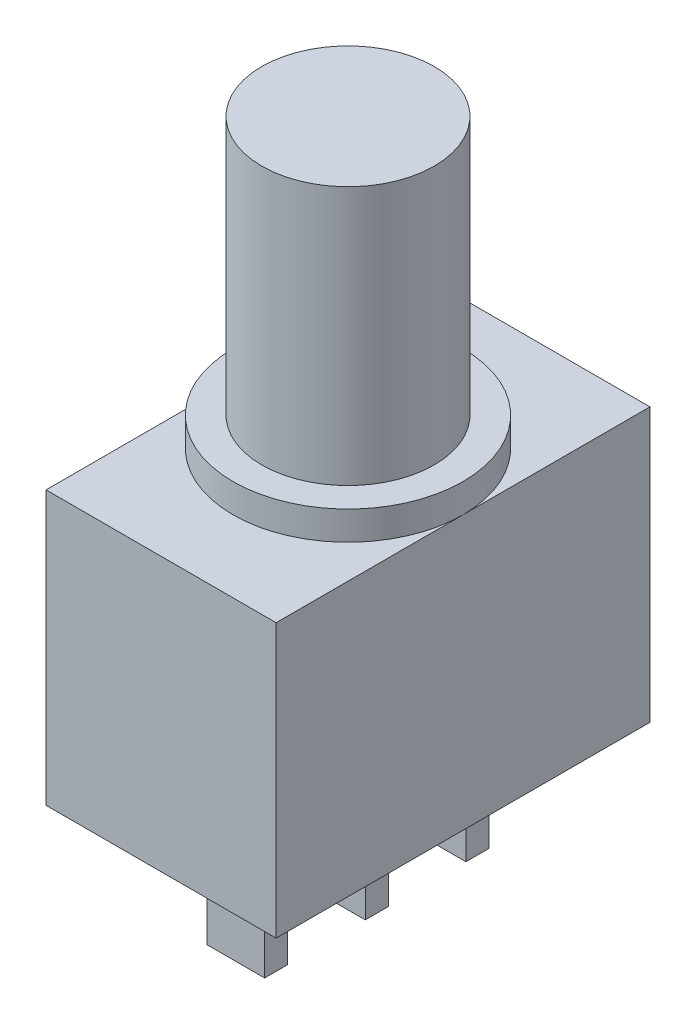
ISO-10303-21;
HEADER;
FILE_DESCRIPTION(('STEP AP214'),'2;1');
FILE_NAME('part.step','',(''),(''),'','','');
FILE_SCHEMA(('AUTOMOTIVE_DESIGN { 1 0 10303 214 1 1 1 1 }'));
ENDSEC;
DATA;
#1=APPLICATION_CONTEXT('core data for automotive mechanical design processes');
#2=APPLICATION_PROTOCOL_DEFINITION('international standard','automotive_design',2000,#1);
#3=PRODUCT_CONTEXT('',#1,'mechanical');
#4=PRODUCT('Part','Part','',(#3));
#5=PRODUCT_RELATED_PRODUCT_CATEGORY('part','',(#4));
#6=PRODUCT_DEFINITION_FORMATION('','',#4);
#7=PRODUCT_DEFINITION_CONTEXT('part definition',#1,'design');
#8=PRODUCT_DEFINITION('design','',#6,#7);
#9=PRODUCT_DEFINITION_SHAPE('','',#8);
#10=(LENGTH_UNIT() NAMED_UNIT(*) SI_UNIT(.MILLI.,.METRE.));
#11=(NAMED_UNIT(*) PLANE_ANGLE_UNIT() SI_UNIT($,.RADIAN.));
#12=(NAMED_UNIT(*) SI_UNIT($,.STERADIAN.) SOLID_ANGLE_UNIT());
#13=UNCERTAINTY_MEASURE_WITH_UNIT(LENGTH_MEASURE(1.E-05),#10,'distance_accuracy_value','');
#14=(GEOMETRIC_REPRESENTATION_CONTEXT(3) GLOBAL_UNCERTAINTY_ASSIGNED_CONTEXT((#13)) GLOBAL_UNIT_ASSIGNED_CONTEXT((#10,
#11,#12)) REPRESENTATION_CONTEXT('',''));
#15=CARTESIAN_POINT('',(0.,0.,0.));
#16=DIRECTION('',(0.,0.,1.));
#17=DIRECTION('',(1.,0.,0.));
#18=AXIS2_PLACEMENT_3D('',#15,#16,#17);
#19=CARTESIAN_POINT('',(8.,0.,0.));
#20=DIRECTION('',(0.,1.,0.));
#21=DIRECTION('',(0.,0.,1.));
#22=AXIS2_PLACEMENT_3D('',#19,#20,#21);
#23=PLANE('',#22);
#24=DIRECTION('',(0.,0.,1.));
#25=VECTOR('',#24,1.);
#26=CARTESIAN_POINT('',(5.,0.,-6.1));
#27=LINE('',#26,#25);
#28=CARTESIAN_POINT('',(5.,0.,-6.9));
#29=VERTEX_POINT('',#28);
#30=CARTESIAN_POINT('',(5.,0.,-6.1));
#31=VERTEX_POINT('',#30);
#32=EDGE_CURVE('E174',#29,#31,#27,.T.);
#33=ORIENTED_EDGE('',*,*,#32,.F.);
#34=DIRECTION('',(1.,0.,0.));
#35=VECTOR('',#34,1.);
#36=CARTESIAN_POINT('',(5.,0.,-6.9));
#37=LINE('',#36,#35);
#38=CARTESIAN_POINT('',(3.,0.,-6.9));
#39=VERTEX_POINT('',#38);
#40=EDGE_CURVE('E187',#39,#29,#37,.T.);
#41=ORIENTED_EDGE('',*,*,#40,.F.);
#42=DIRECTION('',(0.,0.,-1.));
#43=VECTOR('',#42,1.);
#44=CARTESIAN_POINT('',(3.,0.,-6.1));
#45=LINE('',#44,#43);
#46=CARTESIAN_POINT('',(3.,0.,-6.1));
#47=VERTEX_POINT('',#46);
#48=EDGE_CURVE('E196',#47,#39,#45,.T.);
#49=ORIENTED_EDGE('',*,*,#48,.F.);
#50=DIRECTION('',(-1.,0.,0.));
#51=VECTOR('',#50,1.);
#52=CARTESIAN_POINT('',(5.,0.,-6.1));
#53=LINE('',#52,#51);
#54=EDGE_CURVE('E177',#31,#47,#53,.T.);
#55=ORIENTED_EDGE('',*,*,#54,.F.);
#56=EDGE_LOOP('',(#33,#41,#49,#55));
#57=FACE_BOUND('',#56,.T.);
#58=DIRECTION('',(0.,0.,-1.));
#59=VECTOR('',#58,1.);
#60=CARTESIAN_POINT('',(0.,0.,0.));
#61=LINE('',#60,#59);
#62=CARTESIAN_POINT('',(0.,0.,0.));
#63=VERTEX_POINT('',#62);
#64=CARTESIAN_POINT('',(0.,0.,-13.));
#65=VERTEX_POINT('',#64);
#66=EDGE_CURVE('E270',#63,#65,#61,.T.);
#67=ORIENTED_EDGE('',*,*,#66,.T.);
#68=DIRECTION('',(-1.,0.,0.));
#69=VECTOR('',#68,1.);
#70=CARTESIAN_POINT('',(8.,0.,-13.));
#71=LINE('',#70,#69);
#72=CARTESIAN_POINT('',(8.,0.,-13.));
#73=VERTEX_POINT('',#72);
#74=EDGE_CURVE('E281',#73,#65,#71,.T.);
#75=ORIENTED_EDGE('',*,*,#74,.F.);
#76=DIRECTION('',(0.,0.,-1.));
#77=VECTOR('',#76,1.);
#78=CARTESIAN_POINT('',(8.,0.,0.));
#79=LINE('',#78,#77);
#80=CARTESIAN_POINT('',(8.,0.,0.));
#81=VERTEX_POINT('',#80);
#82=EDGE_CURVE('E259',#81,#73,#79,.T.);
#83=ORIENTED_EDGE('',*,*,#82,.F.);
#84=DIRECTION('',(-1.,0.,0.));
#85=VECTOR('',#84,1.);
#86=CARTESIAN_POINT('',(8.,0.,0.));
#87=LINE('',#86,#85);
#88=EDGE_CURVE('E36',#81,#63,#87,.T.);
#89=ORIENTED_EDGE('',*,*,#88,.T.);
#90=EDGE_LOOP('',(#67,#75,#83,#89));
#91=FACE_BOUND('',#90,.T.);
#92=DIRECTION('',(0.,0.,1.));
#93=VECTOR('',#92,1.);
#94=CARTESIAN_POINT('',(5.,0.,-2.6));
#95=LINE('',#94,#93);
#96=CARTESIAN_POINT('',(5.,0.,-3.4));
#97=VERTEX_POINT('',#96);
#98=CARTESIAN_POINT('',(5.,0.,-2.6));
#99=VERTEX_POINT('',#98);
#100=EDGE_CURVE('E212',#97,#99,#95,.T.);
#101=ORIENTED_EDGE('',*,*,#100,.F.);
#102=DIRECTION('',(1.,0.,0.));
#103=VECTOR('',#102,1.);
#104=CARTESIAN_POINT('',(5.,0.,-3.4));
#105=LINE('',#104,#103);
#106=CARTESIAN_POINT('',(3.,0.,-3.4));
#107=VERTEX_POINT('',#106);
#108=EDGE_CURVE('E217',#107,#97,#105,.T.);
#109=ORIENTED_EDGE('',*,*,#108,.F.);
#110=DIRECTION('',(0.,0.,-1.));
#111=VECTOR('',#110,1.);
#112=CARTESIAN_POINT('',(3.,0.,-2.6));
#113=LINE('',#112,#111);
#114=CARTESIAN_POINT('',(3.,0.,-2.6));
#115=VERTEX_POINT('',#114);
#116=EDGE_CURVE('E229',#115,#107,#113,.T.);
#117=ORIENTED_EDGE('',*,*,#116,.F.);
#118=DIRECTION('',(-1.,0.,0.));
#119=VECTOR('',#118,1.);
#120=CARTESIAN_POINT('',(5.,0.,-2.6));
#121=LINE('',#120,#119);
#122=EDGE_CURVE('E226',#99,#115,#121,.T.);
#123=ORIENTED_EDGE('',*,*,#122,.F.);
#124=EDGE_LOOP('',(#101,#109,#117,#123));
#125=FACE_BOUND('',#124,.T.);
#126=DIRECTION('',(0.,0.,1.));
#127=VECTOR('',#126,1.);
#128=CARTESIAN_POINT('',(5.,0.,-9.6));
#129=LINE('',#128,#127);
#130=CARTESIAN_POINT('',(5.,0.,-10.4));
#131=VERTEX_POINT('',#130);
#132=CARTESIAN_POINT('',(5.,0.,-9.6));
#133=VERTEX_POINT('',#132);
#134=EDGE_CURVE('E173',#131,#133,#129,.T.);
#135=ORIENTED_EDGE('',*,*,#134,.F.);
#136=DIRECTION('',(1.,0.,0.));
#137=VECTOR('',#136,1.);
#138=CARTESIAN_POINT('',(5.,0.,-10.4));
#139=LINE('',#138,#137);
#140=CARTESIAN_POINT('',(3.,0.,-10.4));
#141=VERTEX_POINT('',#140);
#142=EDGE_CURVE('E170',#141,#131,#139,.T.);
#143=ORIENTED_EDGE('',*,*,#142,.F.);
#144=DIRECTION('',(0.,0.,-1.));
#145=VECTOR('',#144,1.);
#146=CARTESIAN_POINT('',(3.,0.,-9.6));
#147=LINE('',#146,#145);
#148=CARTESIAN_POINT('',(3.,0.,-9.6));
#149=VERTEX_POINT('',#148);
#150=EDGE_CURVE('E54',#149,#141,#147,.T.);
#151=ORIENTED_EDGE('',*,*,#150,.F.);
#152=DIRECTION('',(-1.,0.,0.));
#153=VECTOR('',#152,1.);
#154=CARTESIAN_POINT('',(5.,0.,-9.6));
#155=LINE('',#154,#153);
#156=EDGE_CURVE('E49',#133,#149,#155,.T.);
#157=ORIENTED_EDGE('',*,*,#156,.F.);
#158=EDGE_LOOP('',(#135,#143,#151,#157));
#159=FACE_BOUND('',#158,.T.);
#160=ADVANCED_FACE('F32',(#57,#91,#125,#159),#23,.F.);
#161=CARTESIAN_POINT('',(4.,10.5,-6.5));
#162=DIRECTION('',(0.,1.,0.));
#163=DIRECTION('',(0.,0.,1.));
#164=AXIS2_PLACEMENT_3D('',#161,#162,#163);
#165=PLANE('',#164);
#166=CARTESIAN_POINT('',(4.,10.5,-6.5));
#167=DIRECTION('',(0.,1.,0.));
#168=DIRECTION('',(0.,0.,1.));
#169=AXIS2_PLACEMENT_3D('',#166,#167,#168);
#170=CIRCLE('',#169,4.);
#171=CARTESIAN_POINT('',(4.,10.5,-2.5));
#172=VERTEX_POINT('',#171);
#173=EDGE_CURVE('E251',#172,#172,#170,.T.);
#174=ORIENTED_EDGE('',*,*,#173,.T.);
#175=EDGE_LOOP('',(#174));
#176=FACE_BOUND('',#175,.T.);
#177=CARTESIAN_POINT('',(4.,10.5,-6.5));
#178=DIRECTION('',(0.,1.,0.));
#179=DIRECTION('',(0.,0.,1.));
#180=AXIS2_PLACEMENT_3D('',#177,#178,#179);
#181=CIRCLE('',#180,3.);
#182=CARTESIAN_POINT('',(4.,10.5,-3.5));
#183=VERTEX_POINT('',#182);
#184=EDGE_CURVE('E245',#183,#183,#181,.T.);
#185=ORIENTED_EDGE('',*,*,#184,.F.);
#186=EDGE_LOOP('',(#185));
#187=FACE_BOUND('',#186,.T.);
#188=ADVANCED_FACE('F328',(#176,#187),#165,.T.);
#189=CARTESIAN_POINT('',(8.,9.5,0.));
#190=DIRECTION('',(0.,-1.,0.));
#191=DIRECTION('',(0.,0.,-1.));
#192=AXIS2_PLACEMENT_3D('',#189,#190,#191);
#193=PLANE('',#192);
#194=CARTESIAN_POINT('',(4.,9.5,-6.5));
#195=DIRECTION('',(0.,1.,0.));
#196=DIRECTION('',(0.,0.,1.));
#197=AXIS2_PLACEMENT_3D('',#194,#195,#196);
#198=CIRCLE('',#197,4.);
#199=CARTESIAN_POINT('',(8.,9.5,-6.5));
#200=VERTEX_POINT('',#199);
#201=CARTESIAN_POINT('',(0.,9.5,-6.5));
#202=VERTEX_POINT('',#201);
#203=EDGE_CURVE('E42',#200,#202,#198,.T.);
#204=ORIENTED_EDGE('',*,*,#203,.F.);
#205=DIRECTION('',(0.,0.,1.));
#206=VECTOR('',#205,1.);
#207=CARTESIAN_POINT('',(8.,9.5,0.));
#208=LINE('',#207,#206);
#209=CARTESIAN_POINT('',(8.,9.5,-13.));
#210=VERTEX_POINT('',#209);
#211=EDGE_CURVE('E265',#210,#200,#208,.T.);
#212=ORIENTED_EDGE('',*,*,#211,.F.);
#213=DIRECTION('',(-1.,0.,0.));
#214=VECTOR('',#213,1.);
#215=CARTESIAN_POINT('',(8.,9.5,-13.));
#216=LINE('',#215,#214);
#217=CARTESIAN_POINT('',(0.,9.5,-13.));
#218=VERTEX_POINT('',#217);
#219=EDGE_CURVE('E279',#210,#218,#216,.T.);
#220=ORIENTED_EDGE('',*,*,#219,.T.);
#221=DIRECTION('',(0.,0.,1.));
#222=VECTOR('',#221,1.);
#223=CARTESIAN_POINT('',(0.,9.5,0.));
#224=LINE('',#223,#222);
#225=EDGE_CURVE('E260',#218,#202,#224,.T.);
#226=ORIENTED_EDGE('',*,*,#225,.T.);
#227=EDGE_LOOP('',(#204,#212,#220,#226));
#228=FACE_BOUND('',#227,.T.);
#229=ADVANCED_FACE('F304',(#228),#193,.F.);
#230=EDGE_CURVE('E11',#202,#200,#198,.T.);
#231=ORIENTED_EDGE('',*,*,#230,.F.);
#232=CARTESIAN_POINT('',(0.,9.5,0.));
#233=VERTEX_POINT('',#232);
#234=EDGE_CURVE('E274',#202,#233,#224,.T.);
#235=ORIENTED_EDGE('',*,*,#234,.T.);
#236=DIRECTION('',(-1.,0.,0.));
#237=VECTOR('',#236,1.);
#238=CARTESIAN_POINT('',(8.,9.5,0.));
#239=LINE('',#238,#237);
#240=CARTESIAN_POINT('',(8.,9.5,0.));
#241=VERTEX_POINT('',#240);
#242=EDGE_CURVE('E267',#241,#233,#239,.T.);
#243=ORIENTED_EDGE('',*,*,#242,.F.);
#244=EDGE_CURVE('E264',#200,#241,#208,.T.);
#245=ORIENTED_EDGE('',*,*,#244,.F.);
#246=EDGE_LOOP('',(#231,#235,#243,#245));
#247=FACE_BOUND('',#246,.T.);
#248=ADVANCED_FACE('F309',(#247),#193,.F.);
#249=CARTESIAN_POINT('',(8.,0.,0.));
#250=DIRECTION('',(0.,0.,-1.));
#251=DIRECTION('',(-1.,0.,0.));
#252=AXIS2_PLACEMENT_3D('',#249,#250,#251);
#253=PLANE('',#252);
#254=DIRECTION('',(0.,-1.,0.));
#255=VECTOR('',#254,1.);
#256=CARTESIAN_POINT('',(0.,0.,0.));
#257=LINE('',#256,#255);
#258=EDGE_CURVE('E253',#233,#63,#257,.T.);
#259=ORIENTED_EDGE('',*,*,#258,.T.);
#260=ORIENTED_EDGE('',*,*,#88,.F.);
#261=DIRECTION('',(0.,-1.,0.));
#262=VECTOR('',#261,1.);
#263=CARTESIAN_POINT('',(8.,0.,0.));
#264=LINE('',#263,#262);
#265=EDGE_CURVE('E256',#241,#81,#264,.T.);
#266=ORIENTED_EDGE('',*,*,#265,.F.);
#267=ORIENTED_EDGE('',*,*,#242,.T.);
#268=EDGE_LOOP('',(#259,#260,#266,#267));
#269=FACE_BOUND('',#268,.T.);
#270=ADVANCED_FACE('F34',(#269),#253,.F.);
#271=CARTESIAN_POINT('',(8.,0.,-13.));
#272=DIRECTION('',(0.,0.,1.));
#273=DIRECTION('',(1.,0.,0.));
#274=AXIS2_PLACEMENT_3D('',#271,#272,#273);
#275=PLANE('',#274);
#276=DIRECTION('',(0.,1.,0.));
#277=VECTOR('',#276,1.);
#278=CARTESIAN_POINT('',(0.,0.,-13.));
#279=LINE('',#278,#277);
#280=EDGE_CURVE('E272',#65,#218,#279,.T.);
#281=ORIENTED_EDGE('',*,*,#280,.T.);
#282=ORIENTED_EDGE('',*,*,#219,.F.);
#283=DIRECTION('',(0.,1.,0.));
#284=VECTOR('',#283,1.);
#285=CARTESIAN_POINT('',(8.,0.,-13.));
#286=LINE('',#285,#284);
#287=EDGE_CURVE('E262',#73,#210,#286,.T.);
#288=ORIENTED_EDGE('',*,*,#287,.F.);
#289=ORIENTED_EDGE('',*,*,#74,.T.);
#290=EDGE_LOOP('',(#281,#282,#288,#289));
#291=FACE_BOUND('',#290,.T.);
#292=ADVANCED_FACE('F300',(#291),#275,.F.);
#293=CARTESIAN_POINT('',(8.,0.,0.));
#294=DIRECTION('',(-1.,0.,0.));
#295=DIRECTION('',(0.,0.,1.));
#296=AXIS2_PLACEMENT_3D('',#293,#294,#295);
#297=PLANE('',#296);
#298=ORIENTED_EDGE('',*,*,#265,.T.);
#299=ORIENTED_EDGE('',*,*,#82,.T.);
#300=ORIENTED_EDGE('',*,*,#287,.T.);
#301=ORIENTED_EDGE('',*,*,#211,.T.);
#302=ORIENTED_EDGE('',*,*,#244,.T.);
#303=EDGE_LOOP('',(#298,#299,#300,#301,#302));
#304=FACE_BOUND('',#303,.T.);
#305=ADVANCED_FACE('F307',(#304),#297,.F.);
#306=CARTESIAN_POINT('',(0.,0.,0.));
#307=DIRECTION('',(-1.,0.,0.));
#308=DIRECTION('',(0.,0.,1.));
#309=AXIS2_PLACEMENT_3D('',#306,#307,#308);
#310=PLANE('',#309);
#311=ORIENTED_EDGE('',*,*,#258,.F.);
#312=ORIENTED_EDGE('',*,*,#234,.F.);
#313=ORIENTED_EDGE('',*,*,#225,.F.);
#314=ORIENTED_EDGE('',*,*,#280,.F.);
#315=ORIENTED_EDGE('',*,*,#66,.F.);
#316=EDGE_LOOP('',(#311,#312,#313,#314,#315));
#317=FACE_BOUND('',#316,.T.);
#318=ADVANCED_FACE('F297',(#317),#310,.T.);
#319=CARTESIAN_POINT('',(4.,10.5,-6.5));
#320=DIRECTION('',(0.,-1.,0.));
#321=DIRECTION('',(0.,0.,-1.));
#322=AXIS2_PLACEMENT_3D('',#319,#320,#321);
#323=CYLINDRICAL_SURFACE('',#322,4.);
#324=ORIENTED_EDGE('',*,*,#173,.F.);
#325=EDGE_LOOP('',(#324));
#326=FACE_BOUND('',#325,.T.);
#327=ORIENTED_EDGE('',*,*,#203,.T.);
#328=ORIENTED_EDGE('',*,*,#230,.T.);
#329=EDGE_LOOP('',(#327,#328));
#330=FACE_BOUND('',#329,.T.);
#331=ADVANCED_FACE('F311',(#326,#330),#323,.T.);
#332=CARTESIAN_POINT('',(4.,19.5,-6.5));
#333=DIRECTION('',(0.,-1.,0.));
#334=DIRECTION('',(0.,0.,-1.));
#335=AXIS2_PLACEMENT_3D('',#332,#333,#334);
#336=CYLINDRICAL_SURFACE('',#335,3.);
#337=CARTESIAN_POINT('',(4.,19.5,-6.5));
#338=DIRECTION('',(0.,1.,0.));
#339=DIRECTION('',(0.,0.,1.));
#340=AXIS2_PLACEMENT_3D('',#337,#338,#339);
#341=CIRCLE('',#340,3.);
#342=CARTESIAN_POINT('',(4.,19.5,-3.5));
#343=VERTEX_POINT('',#342);
#344=EDGE_CURVE('E246',#343,#343,#341,.T.);
#345=ORIENTED_EDGE('',*,*,#344,.F.);
#346=EDGE_LOOP('',(#345));
#347=FACE_BOUND('',#346,.T.);
#348=ORIENTED_EDGE('',*,*,#184,.T.);
#349=EDGE_LOOP('',(#348));
#350=FACE_BOUND('',#349,.T.);
#351=ADVANCED_FACE('F313',(#347,#350),#336,.T.);
#352=CARTESIAN_POINT('',(4.,19.5,-6.5));
#353=DIRECTION('',(0.,1.,0.));
#354=DIRECTION('',(0.,0.,1.));
#355=AXIS2_PLACEMENT_3D('',#352,#353,#354);
#356=PLANE('',#355);
#357=ORIENTED_EDGE('',*,*,#344,.T.);
#358=EDGE_LOOP('',(#357));
#359=FACE_BOUND('',#358,.T.);
#360=ADVANCED_FACE('F320',(#359),#356,.T.);
#361=CARTESIAN_POINT('',(5.,-4.,-2.6));
#362=DIRECTION('',(-1.,0.,0.));
#363=DIRECTION('',(0.,0.,1.));
#364=AXIS2_PLACEMENT_3D('',#361,#362,#363);
#365=PLANE('',#364);
#366=ORIENTED_EDGE('',*,*,#100,.T.);
#367=DIRECTION('',(0.,1.,0.));
#368=VECTOR('',#367,1.);
#369=CARTESIAN_POINT('',(5.,-4.,-2.6));
#370=LINE('',#369,#368);
#371=CARTESIAN_POINT('',(5.,-4.,-2.6));
#372=VERTEX_POINT('',#371);
#373=EDGE_CURVE('E242',#372,#99,#370,.T.);
#374=ORIENTED_EDGE('',*,*,#373,.F.);
#375=DIRECTION('',(0.,0.,1.));
#376=VECTOR('',#375,1.);
#377=CARTESIAN_POINT('',(5.,-4.,-2.6));
#378=LINE('',#377,#376);
#379=CARTESIAN_POINT('',(5.,-4.,-3.4));
#380=VERTEX_POINT('',#379);
#381=EDGE_CURVE('E213',#380,#372,#378,.T.);
#382=ORIENTED_EDGE('',*,*,#381,.F.);
#383=DIRECTION('',(0.,1.,0.));
#384=VECTOR('',#383,1.);
#385=CARTESIAN_POINT('',(5.,-4.,-3.4));
#386=LINE('',#385,#384);
#387=EDGE_CURVE('E223',#380,#97,#386,.T.);
#388=ORIENTED_EDGE('',*,*,#387,.T.);
#389=EDGE_LOOP('',(#366,#374,#382,#388));
#390=FACE_BOUND('',#389,.T.);
#391=ADVANCED_FACE('F375',(#390),#365,.F.);
#392=CARTESIAN_POINT('',(5.,-4.,-2.6));
#393=DIRECTION('',(0.,0.,-1.));
#394=DIRECTION('',(-1.,0.,0.));
#395=AXIS2_PLACEMENT_3D('',#392,#393,#394);
#396=PLANE('',#395);
#397=ORIENTED_EDGE('',*,*,#122,.T.);
#398=DIRECTION('',(0.,1.,0.));
#399=VECTOR('',#398,1.);
#400=CARTESIAN_POINT('',(3.,-4.,-2.6));
#401=LINE('',#400,#399);
#402=CARTESIAN_POINT('',(3.,-4.,-2.6));
#403=VERTEX_POINT('',#402);
#404=EDGE_CURVE('E239',#403,#115,#401,.T.);
#405=ORIENTED_EDGE('',*,*,#404,.F.);
#406=DIRECTION('',(-1.,0.,0.));
#407=VECTOR('',#406,1.);
#408=CARTESIAN_POINT('',(5.,-4.,-2.6));
#409=LINE('',#408,#407);
#410=EDGE_CURVE('E216',#372,#403,#409,.T.);
#411=ORIENTED_EDGE('',*,*,#410,.F.);
#412=ORIENTED_EDGE('',*,*,#373,.T.);
#413=EDGE_LOOP('',(#397,#405,#411,#412));
#414=FACE_BOUND('',#413,.T.);
#415=ADVANCED_FACE('F390',(#414),#396,.F.);
#416=CARTESIAN_POINT('',(3.,-4.,-2.6));
#417=DIRECTION('',(1.,0.,0.));
#418=DIRECTION('',(0.,0.,-1.));
#419=AXIS2_PLACEMENT_3D('',#416,#417,#418);
#420=PLANE('',#419);
#421=ORIENTED_EDGE('',*,*,#116,.T.);
#422=DIRECTION('',(0.,1.,0.));
#423=VECTOR('',#422,1.);
#424=CARTESIAN_POINT('',(3.,-4.,-3.4));
#425=LINE('',#424,#423);
#426=CARTESIAN_POINT('',(3.,-4.,-3.4));
#427=VERTEX_POINT('',#426);
#428=EDGE_CURVE('E236',#427,#107,#425,.T.);
#429=ORIENTED_EDGE('',*,*,#428,.F.);
#430=DIRECTION('',(0.,0.,-1.));
#431=VECTOR('',#430,1.);
#432=CARTESIAN_POINT('',(3.,-4.,-2.6));
#433=LINE('',#432,#431);
#434=EDGE_CURVE('E219',#403,#427,#433,.T.);
#435=ORIENTED_EDGE('',*,*,#434,.F.);
#436=ORIENTED_EDGE('',*,*,#404,.T.);
#437=EDGE_LOOP('',(#421,#429,#435,#436));
#438=FACE_BOUND('',#437,.T.);
#439=ADVANCED_FACE('F400',(#438),#420,.F.);
#440=CARTESIAN_POINT('',(5.,-4.,-3.4));
#441=DIRECTION('',(0.,0.,1.));
#442=DIRECTION('',(1.,0.,0.));
#443=AXIS2_PLACEMENT_3D('',#440,#441,#442);
#444=PLANE('',#443);
#445=ORIENTED_EDGE('',*,*,#108,.T.);
#446=ORIENTED_EDGE('',*,*,#387,.F.);
#447=DIRECTION('',(1.,0.,0.));
#448=VECTOR('',#447,1.);
#449=CARTESIAN_POINT('',(5.,-4.,-3.4));
#450=LINE('',#449,#448);
#451=EDGE_CURVE('E221',#427,#380,#450,.T.);
#452=ORIENTED_EDGE('',*,*,#451,.F.);
#453=ORIENTED_EDGE('',*,*,#428,.T.);
#454=EDGE_LOOP('',(#445,#446,#452,#453));
#455=FACE_BOUND('',#454,.T.);
#456=ADVANCED_FACE('F410',(#455),#444,.F.);
#457=CARTESIAN_POINT('',(0.,-4.,0.));
#458=DIRECTION('',(0.,1.,0.));
#459=DIRECTION('',(0.,0.,1.));
#460=AXIS2_PLACEMENT_3D('',#457,#458,#459);
#461=PLANE('',#460);
#462=ORIENTED_EDGE('',*,*,#381,.T.);
#463=ORIENTED_EDGE('',*,*,#410,.T.);
#464=ORIENTED_EDGE('',*,*,#434,.T.);
#465=ORIENTED_EDGE('',*,*,#451,.T.);
#466=EDGE_LOOP('',(#462,#463,#464,#465));
#467=FACE_BOUND('',#466,.T.);
#468=ADVANCED_FACE('F420',(#467),#461,.F.);
#469=CARTESIAN_POINT('',(5.,-4.,-6.1));
#470=DIRECTION('',(-1.,0.,0.));
#471=DIRECTION('',(0.,0.,1.));
#472=AXIS2_PLACEMENT_3D('',#469,#470,#471);
#473=PLANE('',#472);
#474=ORIENTED_EDGE('',*,*,#32,.T.);
#475=DIRECTION('',(0.,1.,0.));
#476=VECTOR('',#475,1.);
#477=CARTESIAN_POINT('',(5.,-4.,-6.1));
#478=LINE('',#477,#476);
#479=CARTESIAN_POINT('',(5.,-4.,-6.1));
#480=VERTEX_POINT('',#479);
#481=EDGE_CURVE('E209',#480,#31,#478,.T.);
#482=ORIENTED_EDGE('',*,*,#481,.F.);
#483=DIRECTION('',(0.,0.,1.));
#484=VECTOR('',#483,1.);
#485=CARTESIAN_POINT('',(5.,-4.,-6.1));
#486=LINE('',#485,#484);
#487=CARTESIAN_POINT('',(5.,-4.,-6.9));
#488=VERTEX_POINT('',#487);
#489=EDGE_CURVE('E183',#488,#480,#486,.T.);
#490=ORIENTED_EDGE('',*,*,#489,.F.);
#491=DIRECTION('',(0.,1.,0.));
#492=VECTOR('',#491,1.);
#493=CARTESIAN_POINT('',(5.,-4.,-6.9));
#494=LINE('',#493,#492);
#495=EDGE_CURVE('E192',#488,#29,#494,.T.);
#496=ORIENTED_EDGE('',*,*,#495,.T.);
#497=EDGE_LOOP('',(#474,#482,#490,#496));
#498=FACE_BOUND('',#497,.T.);
#499=ADVANCED_FACE('F430',(#498),#473,.F.);
#500=CARTESIAN_POINT('',(5.,-4.,-6.1));
#501=DIRECTION('',(0.,0.,-1.));
#502=DIRECTION('',(-1.,0.,0.));
#503=AXIS2_PLACEMENT_3D('',#500,#501,#502);
#504=PLANE('',#503);
#505=ORIENTED_EDGE('',*,*,#54,.T.);
#506=DIRECTION('',(0.,1.,0.));
#507=VECTOR('',#506,1.);
#508=CARTESIAN_POINT('',(3.,-4.,-6.1));
#509=LINE('',#508,#507);
#510=CARTESIAN_POINT('',(3.,-4.,-6.1));
#511=VERTEX_POINT('',#510);
#512=EDGE_CURVE('E206',#511,#47,#509,.T.);
#513=ORIENTED_EDGE('',*,*,#512,.F.);
#514=DIRECTION('',(-1.,0.,0.));
#515=VECTOR('',#514,1.);
#516=CARTESIAN_POINT('',(5.,-4.,-6.1));
#517=LINE('',#516,#515);
#518=EDGE_CURVE('E186',#480,#511,#517,.T.);
#519=ORIENTED_EDGE('',*,*,#518,.F.);
#520=ORIENTED_EDGE('',*,*,#481,.T.);
#521=EDGE_LOOP('',(#505,#513,#519,#520));
#522=FACE_BOUND('',#521,.T.);
#523=ADVANCED_FACE('F440',(#522),#504,.F.);
#524=CARTESIAN_POINT('',(3.,-4.,-6.1));
#525=DIRECTION('',(1.,0.,0.));
#526=DIRECTION('',(0.,0.,-1.));
#527=AXIS2_PLACEMENT_3D('',#524,#525,#526);
#528=PLANE('',#527);
#529=ORIENTED_EDGE('',*,*,#48,.T.);
#530=DIRECTION('',(0.,1.,0.));
#531=VECTOR('',#530,1.);
#532=CARTESIAN_POINT('',(3.,-4.,-6.9));
#533=LINE('',#532,#531);
#534=CARTESIAN_POINT('',(3.,-4.,-6.9));
#535=VERTEX_POINT('',#534);
#536=EDGE_CURVE('E203',#535,#39,#533,.T.);
#537=ORIENTED_EDGE('',*,*,#536,.F.);
#538=DIRECTION('',(0.,0.,-1.));
#539=VECTOR('',#538,1.);
#540=CARTESIAN_POINT('',(3.,-4.,-6.1));
#541=LINE('',#540,#539);
#542=EDGE_CURVE('E189',#511,#535,#541,.T.);
#543=ORIENTED_EDGE('',*,*,#542,.F.);
#544=ORIENTED_EDGE('',*,*,#512,.T.);
#545=EDGE_LOOP('',(#529,#537,#543,#544));
#546=FACE_BOUND('',#545,.T.);
#547=ADVANCED_FACE('F450',(#546),#528,.F.);
#548=CARTESIAN_POINT('',(5.,-4.,-6.9));
#549=DIRECTION('',(0.,0.,1.));
#550=DIRECTION('',(1.,0.,0.));
#551=AXIS2_PLACEMENT_3D('',#548,#549,#550);
#552=PLANE('',#551);
#553=ORIENTED_EDGE('',*,*,#40,.T.);
#554=ORIENTED_EDGE('',*,*,#495,.F.);
#555=DIRECTION('',(1.,0.,0.));
#556=VECTOR('',#555,1.);
#557=CARTESIAN_POINT('',(5.,-4.,-6.9));
#558=LINE('',#557,#556);
#559=EDGE_CURVE('E191',#535,#488,#558,.T.);
#560=ORIENTED_EDGE('',*,*,#559,.F.);
#561=ORIENTED_EDGE('',*,*,#536,.T.);
#562=EDGE_LOOP('',(#553,#554,#560,#561));
#563=FACE_BOUND('',#562,.T.);
#564=ADVANCED_FACE('F460',(#563),#552,.F.);
#565=CARTESIAN_POINT('',(0.,-4.,0.));
#566=DIRECTION('',(0.,1.,0.));
#567=DIRECTION('',(0.,0.,1.));
#568=AXIS2_PLACEMENT_3D('',#565,#566,#567);
#569=PLANE('',#568);
#570=ORIENTED_EDGE('',*,*,#489,.T.);
#571=ORIENTED_EDGE('',*,*,#518,.T.);
#572=ORIENTED_EDGE('',*,*,#542,.T.);
#573=ORIENTED_EDGE('',*,*,#559,.T.);
#574=EDGE_LOOP('',(#570,#571,#572,#573));
#575=FACE_BOUND('',#574,.T.);
#576=ADVANCED_FACE('F470',(#575),#569,.F.);
#577=CARTESIAN_POINT('',(5.,-4.,-9.6));
#578=DIRECTION('',(-1.,0.,0.));
#579=DIRECTION('',(0.,0.,1.));
#580=AXIS2_PLACEMENT_3D('',#577,#578,#579);
#581=PLANE('',#580);
#582=ORIENTED_EDGE('',*,*,#134,.T.);
#583=DIRECTION('',(0.,1.,0.));
#584=VECTOR('',#583,1.);
#585=CARTESIAN_POINT('',(5.,-4.,-9.6));
#586=LINE('',#585,#584);
#587=CARTESIAN_POINT('',(5.,-4.,-9.6));
#588=VERTEX_POINT('',#587);
#589=EDGE_CURVE('E154',#588,#133,#586,.T.);
#590=ORIENTED_EDGE('',*,*,#589,.F.);
#591=DIRECTION('',(0.,0.,1.));
#592=VECTOR('',#591,1.);
#593=CARTESIAN_POINT('',(5.,-4.,-9.6));
#594=LINE('',#593,#592);
#595=CARTESIAN_POINT('',(5.,-4.,-10.4));
#596=VERTEX_POINT('',#595);
#597=EDGE_CURVE('E161',#596,#588,#594,.T.);
#598=ORIENTED_EDGE('',*,*,#597,.F.);
#599=DIRECTION('',(0.,1.,0.));
#600=VECTOR('',#599,1.);
#601=CARTESIAN_POINT('',(5.,-4.,-10.4));
#602=LINE('',#601,#600);
#603=EDGE_CURVE('E530',#596,#131,#602,.T.);
#604=ORIENTED_EDGE('',*,*,#603,.T.);
#605=EDGE_LOOP('',(#582,#590,#598,#604));
#606=FACE_BOUND('',#605,.T.);
#607=ADVANCED_FACE('F172',(#606),#581,.F.);
#608=CARTESIAN_POINT('',(5.,-4.,-9.6));
#609=DIRECTION('',(0.,0.,-1.));
#610=DIRECTION('',(-1.,0.,0.));
#611=AXIS2_PLACEMENT_3D('',#608,#609,#610);
#612=PLANE('',#611);
#613=ORIENTED_EDGE('',*,*,#156,.T.);
#614=DIRECTION('',(0.,1.,0.));
#615=VECTOR('',#614,1.);
#616=CARTESIAN_POINT('',(3.,-4.,-9.6));
#617=LINE('',#616,#615);
#618=CARTESIAN_POINT('',(3.,-4.,-9.6));
#619=VERTEX_POINT('',#618);
#620=EDGE_CURVE('E157',#619,#149,#617,.T.);
#621=ORIENTED_EDGE('',*,*,#620,.F.);
#622=DIRECTION('',(-1.,0.,0.));
#623=VECTOR('',#622,1.);
#624=CARTESIAN_POINT('',(5.,-4.,-9.6));
#625=LINE('',#624,#623);
#626=EDGE_CURVE('E150',#588,#619,#625,.T.);
#627=ORIENTED_EDGE('',*,*,#626,.F.);
#628=ORIENTED_EDGE('',*,*,#589,.T.);
#629=EDGE_LOOP('',(#613,#621,#627,#628));
#630=FACE_BOUND('',#629,.T.);
#631=ADVANCED_FACE('F152',(#630),#612,.F.);
#632=CARTESIAN_POINT('',(3.,-4.,-9.6));
#633=DIRECTION('',(1.,0.,0.));
#634=DIRECTION('',(0.,0.,-1.));
#635=AXIS2_PLACEMENT_3D('',#632,#633,#634);
#636=PLANE('',#635);
#637=ORIENTED_EDGE('',*,*,#150,.T.);
#638=DIRECTION('',(0.,1.,0.));
#639=VECTOR('',#638,1.);
#640=CARTESIAN_POINT('',(3.,-4.,-10.4));
#641=LINE('',#640,#639);
#642=CARTESIAN_POINT('',(3.,-4.,-10.4));
#643=VERTEX_POINT('',#642);
#644=EDGE_CURVE('E179',#643,#141,#641,.T.);
#645=ORIENTED_EDGE('',*,*,#644,.F.);
#646=DIRECTION('',(0.,0.,-1.));
#647=VECTOR('',#646,1.);
#648=CARTESIAN_POINT('',(3.,-4.,-9.6));
#649=LINE('',#648,#647);
#650=EDGE_CURVE('E160',#619,#643,#649,.T.);
#651=ORIENTED_EDGE('',*,*,#650,.F.);
#652=ORIENTED_EDGE('',*,*,#620,.T.);
#653=EDGE_LOOP('',(#637,#645,#651,#652));
#654=FACE_BOUND('',#653,.T.);
#655=ADVANCED_FACE('F497',(#654),#636,.F.);
#656=CARTESIAN_POINT('',(5.,-4.,-10.4));
#657=DIRECTION('',(0.,0.,1.));
#658=DIRECTION('',(1.,0.,0.));
#659=AXIS2_PLACEMENT_3D('',#656,#657,#658);
#660=PLANE('',#659);
#661=ORIENTED_EDGE('',*,*,#142,.T.);
#662=ORIENTED_EDGE('',*,*,#603,.F.);
#663=DIRECTION('',(1.,0.,0.));
#664=VECTOR('',#663,1.);
#665=CARTESIAN_POINT('',(5.,-4.,-10.4));
#666=LINE('',#665,#664);
#667=EDGE_CURVE('E166',#643,#596,#666,.T.);
#668=ORIENTED_EDGE('',*,*,#667,.F.);
#669=ORIENTED_EDGE('',*,*,#644,.T.);
#670=EDGE_LOOP('',(#661,#662,#668,#669));
#671=FACE_BOUND('',#670,.T.);
#672=ADVANCED_FACE('F506',(#671),#660,.F.);
#673=CARTESIAN_POINT('',(0.,-4.,0.));
#674=DIRECTION('',(0.,1.,0.));
#675=DIRECTION('',(0.,0.,1.));
#676=AXIS2_PLACEMENT_3D('',#673,#674,#675);
#677=PLANE('',#676);
#678=ORIENTED_EDGE('',*,*,#597,.T.);
#679=ORIENTED_EDGE('',*,*,#626,.T.);
#680=ORIENTED_EDGE('',*,*,#650,.T.);
#681=ORIENTED_EDGE('',*,*,#667,.T.);
#682=EDGE_LOOP('',(#678,#679,#680,#681));
#683=FACE_BOUND('',#682,.T.);
#684=ADVANCED_FACE('F164',(#683),#677,.F.);
#685=CLOSED_SHELL('',(#160,#188,#229,#248,#270,#292,#305,#318,#331,#351,#360,#391,#415,#439,
#456,#468,#499,#523,#547,#564,#576,#607,#631,#655,#672,#684));
#686=MANIFOLD_SOLID_BREP('B2',#685);
#687=ADVANCED_BREP_SHAPE_REPRESENTATION('',(#18,#686),#14);
#688=SHAPE_DEFINITION_REPRESENTATION(#9,#687);
ENDSEC;
END-ISO-10303-21;
